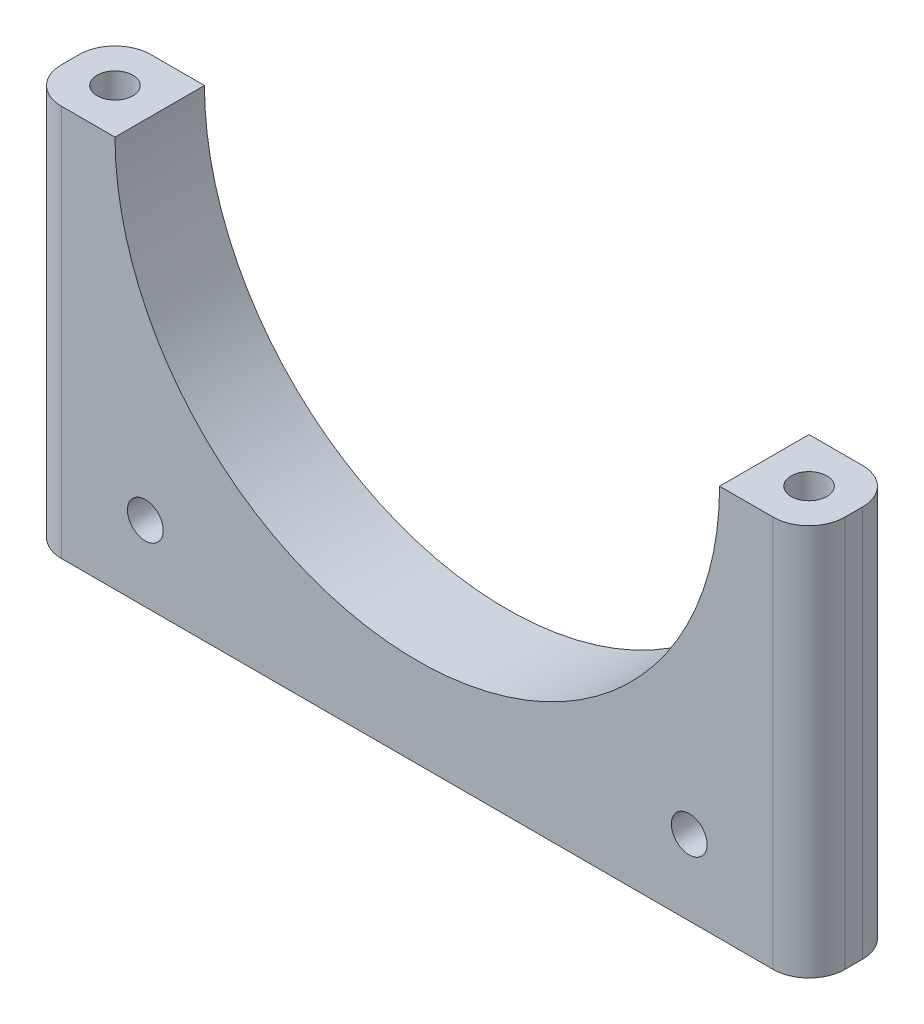
ISO-10303-21;
HEADER;
FILE_DESCRIPTION(('STEP AP214'),'2;1');
FILE_NAME('part.step','',(''),(''),'','','');
FILE_SCHEMA(('AUTOMOTIVE_DESIGN { 1 0 10303 214 1 1 1 1 }'));
ENDSEC;
DATA;
#1=APPLICATION_CONTEXT('core data for automotive mechanical design processes');
#2=APPLICATION_PROTOCOL_DEFINITION('international standard','automotive_design',2000,#1);
#3=PRODUCT_CONTEXT('',#1,'mechanical');
#4=PRODUCT('Part','Part','',(#3));
#5=PRODUCT_RELATED_PRODUCT_CATEGORY('part','',(#4));
#6=PRODUCT_DEFINITION_FORMATION('','',#4);
#7=PRODUCT_DEFINITION_CONTEXT('part definition',#1,'design');
#8=PRODUCT_DEFINITION('design','',#6,#7);
#9=PRODUCT_DEFINITION_SHAPE('','',#8);
#10=(LENGTH_UNIT() NAMED_UNIT(*) SI_UNIT(.MILLI.,.METRE.));
#11=(NAMED_UNIT(*) PLANE_ANGLE_UNIT() SI_UNIT($,.RADIAN.));
#12=(NAMED_UNIT(*) SI_UNIT($,.STERADIAN.) SOLID_ANGLE_UNIT());
#13=UNCERTAINTY_MEASURE_WITH_UNIT(LENGTH_MEASURE(1.E-05),#10,'distance_accuracy_value','');
#14=(GEOMETRIC_REPRESENTATION_CONTEXT(3) GLOBAL_UNCERTAINTY_ASSIGNED_CONTEXT((#13)) GLOBAL_UNIT_ASSIGNED_CONTEXT((#10,
#11,#12)) REPRESENTATION_CONTEXT('',''));
#15=CARTESIAN_POINT('',(0.,0.,0.));
#16=DIRECTION('',(0.,0.,1.));
#17=DIRECTION('',(1.,0.,0.));
#18=AXIS2_PLACEMENT_3D('',#15,#16,#17);
#19=CARTESIAN_POINT('',(0.,0.,25.));
#20=DIRECTION('',(0.,0.,1.));
#21=DIRECTION('',(1.,0.,0.));
#22=AXIS2_PLACEMENT_3D('',#19,#20,#21);
#23=PLANE('',#22);
#24=CARTESIAN_POINT('',(76.015,-3.99999999999999,25.));
#25=DIRECTION('',(0.,0.,1.));
#26=DIRECTION('',(1.,0.,0.));
#27=AXIS2_PLACEMENT_3D('',#24,#25,#26);
#28=CIRCLE('',#27,5.);
#29=CARTESIAN_POINT('',(81.015,-3.99999999999999,25.));
#30=VERTEX_POINT('',#29);
#31=EDGE_CURVE('E277',#30,#30,#28,.F.);
#32=ORIENTED_EDGE('',*,*,#31,.T.);
#33=EDGE_LOOP('',(#32));
#34=FACE_BOUND('',#33,.T.);
#35=DIRECTION('',(-1.,0.,0.));
#36=VECTOR('',#35,1.);
#37=CARTESIAN_POINT('',(0.,-25.,25.));
#38=LINE('',#37,#36);
#39=CARTESIAN_POINT('',(99.5,-25.,25.));
#40=VERTEX_POINT('',#39);
#41=CARTESIAN_POINT('',(-99.5,-25.,25.));
#42=VERTEX_POINT('',#41);
#43=EDGE_CURVE('E149',#40,#42,#38,.T.);
#44=ORIENTED_EDGE('',*,*,#43,.F.);
#45=DIRECTION('',(0.,-1.,0.));
#46=VECTOR('',#45,1.);
#47=CARTESIAN_POINT('',(99.5,0.,25.));
#48=LINE('',#47,#46);
#49=CARTESIAN_POINT('',(99.5,84.5,25.));
#50=VERTEX_POINT('',#49);
#51=EDGE_CURVE('E147',#40,#50,#48,.F.);
#52=ORIENTED_EDGE('',*,*,#51,.T.);
#53=DIRECTION('',(1.,0.,0.));
#54=VECTOR('',#53,1.);
#55=CARTESIAN_POINT('',(0.,84.5,25.));
#56=LINE('',#55,#54);
#57=CARTESIAN_POINT('',(84.5,84.5,25.));
#58=VERTEX_POINT('',#57);
#59=EDGE_CURVE('E128',#58,#50,#56,.T.);
#60=ORIENTED_EDGE('',*,*,#59,.F.);
#61=CARTESIAN_POINT('',(0.,84.5,25.));
#62=DIRECTION('',(0.,0.,1.));
#63=DIRECTION('',(1.,0.,0.));
#64=AXIS2_PLACEMENT_3D('',#61,#62,#63);
#65=CIRCLE('',#64,84.5);
#66=CARTESIAN_POINT('',(-84.5,84.5,25.));
#67=VERTEX_POINT('',#66);
#68=EDGE_CURVE('E145',#67,#58,#65,.T.);
#69=ORIENTED_EDGE('',*,*,#68,.F.);
#70=CARTESIAN_POINT('',(-99.5,84.5,25.));
#71=VERTEX_POINT('',#70);
#72=EDGE_CURVE('E151',#71,#67,#56,.T.);
#73=ORIENTED_EDGE('',*,*,#72,.F.);
#74=DIRECTION('',(0.,-1.,0.));
#75=VECTOR('',#74,1.);
#76=CARTESIAN_POINT('',(-99.5,-25.,25.));
#77=LINE('',#76,#75);
#78=EDGE_CURVE('E216',#71,#42,#77,.T.);
#79=ORIENTED_EDGE('',*,*,#78,.T.);
#80=EDGE_LOOP('',(#44,#52,#60,#69,#73,#79));
#81=FACE_BOUND('',#80,.T.);
#82=CARTESIAN_POINT('',(-76.015,-4.00000000000001,25.));
#83=DIRECTION('',(0.,0.,1.));
#84=DIRECTION('',(1.,0.,0.));
#85=AXIS2_PLACEMENT_3D('',#82,#83,#84);
#86=CIRCLE('',#85,4.99999999999999);
#87=CARTESIAN_POINT('',(-71.015,-4.00000000000001,25.));
#88=VERTEX_POINT('',#87);
#89=EDGE_CURVE('E193',#88,#88,#86,.T.);
#90=ORIENTED_EDGE('',*,*,#89,.F.);
#91=EDGE_LOOP('',(#90));
#92=FACE_BOUND('',#91,.T.);
#93=ADVANCED_FACE('F47',(#34,#81,#92),#23,.T.);
#94=CARTESIAN_POINT('',(0.,0.,0.));
#95=DIRECTION('',(0.,0.,1.));
#96=DIRECTION('',(1.,0.,0.));
#97=AXIS2_PLACEMENT_3D('',#94,#95,#96);
#98=PLANE('',#97);
#99=DIRECTION('',(1.,0.,0.));
#100=VECTOR('',#99,1.);
#101=CARTESIAN_POINT('',(0.,84.5,0.));
#102=LINE('',#101,#100);
#103=CARTESIAN_POINT('',(84.5,84.5,0.));
#104=VERTEX_POINT('',#103);
#105=CARTESIAN_POINT('',(99.5,84.5,0.));
#106=VERTEX_POINT('',#105);
#107=EDGE_CURVE('E131',#104,#106,#102,.T.);
#108=ORIENTED_EDGE('',*,*,#107,.T.);
#109=DIRECTION('',(0.,-1.,0.));
#110=VECTOR('',#109,1.);
#111=CARTESIAN_POINT('',(99.5,-25.,0.));
#112=LINE('',#111,#110);
#113=CARTESIAN_POINT('',(99.5,-25.,0.));
#114=VERTEX_POINT('',#113);
#115=EDGE_CURVE('E231',#106,#114,#112,.T.);
#116=ORIENTED_EDGE('',*,*,#115,.T.);
#117=DIRECTION('',(-1.,0.,0.));
#118=VECTOR('',#117,1.);
#119=CARTESIAN_POINT('',(0.,-25.,0.));
#120=LINE('',#119,#118);
#121=CARTESIAN_POINT('',(-99.5,-25.,0.));
#122=VERTEX_POINT('',#121);
#123=EDGE_CURVE('E161',#114,#122,#120,.T.);
#124=ORIENTED_EDGE('',*,*,#123,.T.);
#125=DIRECTION('',(0.,-1.,0.));
#126=VECTOR('',#125,1.);
#127=CARTESIAN_POINT('',(-99.5,0.,0.));
#128=LINE('',#127,#126);
#129=CARTESIAN_POINT('',(-99.5,84.5,0.));
#130=VERTEX_POINT('',#129);
#131=EDGE_CURVE('E228',#122,#130,#128,.F.);
#132=ORIENTED_EDGE('',*,*,#131,.T.);
#133=CARTESIAN_POINT('',(-84.5,84.5,0.));
#134=VERTEX_POINT('',#133);
#135=EDGE_CURVE('E169',#130,#134,#102,.T.);
#136=ORIENTED_EDGE('',*,*,#135,.T.);
#137=CARTESIAN_POINT('',(0.,84.5,0.));
#138=DIRECTION('',(0.,0.,1.));
#139=DIRECTION('',(1.,0.,0.));
#140=AXIS2_PLACEMENT_3D('',#137,#138,#139);
#141=CIRCLE('',#140,84.5);
#142=EDGE_CURVE('E168',#134,#104,#141,.T.);
#143=ORIENTED_EDGE('',*,*,#142,.T.);
#144=EDGE_LOOP('',(#108,#116,#124,#132,#136,#143));
#145=FACE_BOUND('',#144,.T.);
#146=CARTESIAN_POINT('',(76.015,-3.99999999999999,0.));
#147=DIRECTION('',(0.,0.,1.));
#148=DIRECTION('',(1.,0.,0.));
#149=AXIS2_PLACEMENT_3D('',#146,#147,#148);
#150=CIRCLE('',#149,5.);
#151=CARTESIAN_POINT('',(81.015,-3.99999999999999,0.));
#152=VERTEX_POINT('',#151);
#153=EDGE_CURVE('E188',#152,#152,#150,.F.);
#154=ORIENTED_EDGE('',*,*,#153,.F.);
#155=EDGE_LOOP('',(#154));
#156=FACE_BOUND('',#155,.T.);
#157=CARTESIAN_POINT('',(-76.015,-4.00000000000001,0.));
#158=DIRECTION('',(0.,0.,1.));
#159=DIRECTION('',(1.,0.,0.));
#160=AXIS2_PLACEMENT_3D('',#157,#158,#159);
#161=CIRCLE('',#160,4.99999999999999);
#162=CARTESIAN_POINT('',(-71.015,-4.00000000000001,0.));
#163=VERTEX_POINT('',#162);
#164=EDGE_CURVE('E192',#163,#163,#161,.T.);
#165=ORIENTED_EDGE('',*,*,#164,.T.);
#166=EDGE_LOOP('',(#165));
#167=FACE_BOUND('',#166,.T.);
#168=ADVANCED_FACE('F256',(#145,#156,#167),#98,.F.);
#169=CARTESIAN_POINT('',(0.,-25.,25.));
#170=DIRECTION('',(0.,-1.,0.));
#171=DIRECTION('',(0.,0.,-1.));
#172=AXIS2_PLACEMENT_3D('',#169,#170,#171);
#173=PLANE('',#172);
#174=CARTESIAN_POINT('',(97.,-25.0000000000004,12.5));
#175=DIRECTION('',(0.,-1.,0.));
#176=DIRECTION('',(0.,0.,-1.));
#177=AXIS2_PLACEMENT_3D('',#174,#175,#176);
#178=CIRCLE('',#177,5.);
#179=CARTESIAN_POINT('',(97.,-25.0000000000004,7.49999999999997));
#180=VERTEX_POINT('',#179);
#181=EDGE_CURVE('E165',#180,#180,#178,.F.);
#182=ORIENTED_EDGE('',*,*,#181,.T.);
#183=EDGE_LOOP('',(#182));
#184=FACE_BOUND('',#183,.T.);
#185=DIRECTION('',(0.,0.,-1.));
#186=VECTOR('',#185,1.);
#187=CARTESIAN_POINT('',(109.5,-25.,25.));
#188=LINE('',#187,#186);
#189=CARTESIAN_POINT('',(109.5,-25.,15.));
#190=VERTEX_POINT('',#189);
#191=CARTESIAN_POINT('',(109.5,-25.,10.));
#192=VERTEX_POINT('',#191);
#193=EDGE_CURVE('E183',#190,#192,#188,.T.);
#194=ORIENTED_EDGE('',*,*,#193,.F.);
#195=CARTESIAN_POINT('',(99.5,-25.,15.));
#196=DIRECTION('',(0.,-1.,0.));
#197=DIRECTION('',(0.,0.,-1.));
#198=AXIS2_PLACEMENT_3D('',#195,#196,#197);
#199=CIRCLE('',#198,10.);
#200=EDGE_CURVE('E213',#190,#40,#199,.T.);
#201=ORIENTED_EDGE('',*,*,#200,.T.);
#202=ORIENTED_EDGE('',*,*,#43,.T.);
#203=CARTESIAN_POINT('',(-99.5,-25.,15.));
#204=DIRECTION('',(0.,-1.,0.));
#205=DIRECTION('',(0.,0.,-1.));
#206=AXIS2_PLACEMENT_3D('',#203,#204,#205);
#207=CIRCLE('',#206,10.);
#208=CARTESIAN_POINT('',(-109.5,-25.,15.));
#209=VERTEX_POINT('',#208);
#210=EDGE_CURVE('E207',#42,#209,#207,.T.);
#211=ORIENTED_EDGE('',*,*,#210,.T.);
#212=DIRECTION('',(0.,0.,-1.));
#213=VECTOR('',#212,1.);
#214=CARTESIAN_POINT('',(-109.5,-25.,25.));
#215=LINE('',#214,#213);
#216=CARTESIAN_POINT('',(-109.5,-25.,10.));
#217=VERTEX_POINT('',#216);
#218=EDGE_CURVE('E158',#209,#217,#215,.T.);
#219=ORIENTED_EDGE('',*,*,#218,.T.);
#220=CARTESIAN_POINT('',(-99.5,-25.,10.));
#221=DIRECTION('',(0.,-1.,0.));
#222=DIRECTION('',(0.,0.,-1.));
#223=AXIS2_PLACEMENT_3D('',#220,#221,#222);
#224=CIRCLE('',#223,10.);
#225=EDGE_CURVE('E204',#217,#122,#224,.T.);
#226=ORIENTED_EDGE('',*,*,#225,.T.);
#227=ORIENTED_EDGE('',*,*,#123,.F.);
#228=CARTESIAN_POINT('',(99.5,-25.,10.));
#229=DIRECTION('',(0.,-1.,0.));
#230=DIRECTION('',(0.,0.,-1.));
#231=AXIS2_PLACEMENT_3D('',#228,#229,#230);
#232=CIRCLE('',#231,10.);
#233=EDGE_CURVE('E210',#114,#192,#232,.T.);
#234=ORIENTED_EDGE('',*,*,#233,.T.);
#235=EDGE_LOOP('',(#194,#201,#202,#211,#219,#226,#227,#234));
#236=FACE_BOUND('',#235,.T.);
#237=CARTESIAN_POINT('',(-97.,-25.0000000000004,12.5));
#238=DIRECTION('',(0.,-1.,0.));
#239=DIRECTION('',(0.,0.,-1.));
#240=AXIS2_PLACEMENT_3D('',#237,#238,#239);
#241=CIRCLE('',#240,5.);
#242=CARTESIAN_POINT('',(-97.,-25.0000000000004,7.5));
#243=VERTEX_POINT('',#242);
#244=EDGE_CURVE('E266',#243,#243,#241,.T.);
#245=ORIENTED_EDGE('',*,*,#244,.F.);
#246=EDGE_LOOP('',(#245));
#247=FACE_BOUND('',#246,.T.);
#248=ADVANCED_FACE('F246',(#184,#236,#247),#173,.T.);
#249=CARTESIAN_POINT('',(109.5,0.,25.));
#250=DIRECTION('',(1.,0.,0.));
#251=DIRECTION('',(0.,1.,0.));
#252=AXIS2_PLACEMENT_3D('',#249,#250,#251);
#253=PLANE('',#252);
#254=DIRECTION('',(0.,0.,-1.));
#255=VECTOR('',#254,1.);
#256=CARTESIAN_POINT('',(109.5,84.5,25.));
#257=LINE('',#256,#255);
#258=CARTESIAN_POINT('',(109.5,84.5,15.));
#259=VERTEX_POINT('',#258);
#260=CARTESIAN_POINT('',(109.5,84.5,10.));
#261=VERTEX_POINT('',#260);
#262=EDGE_CURVE('E137',#259,#261,#257,.T.);
#263=ORIENTED_EDGE('',*,*,#262,.F.);
#264=DIRECTION('',(0.,-1.,0.));
#265=VECTOR('',#264,1.);
#266=CARTESIAN_POINT('',(109.5,0.,15.));
#267=LINE('',#266,#265);
#268=EDGE_CURVE('E200',#259,#190,#267,.T.);
#269=ORIENTED_EDGE('',*,*,#268,.T.);
#270=ORIENTED_EDGE('',*,*,#193,.T.);
#271=DIRECTION('',(0.,-1.,0.));
#272=VECTOR('',#271,1.);
#273=CARTESIAN_POINT('',(109.5,84.5,10.));
#274=LINE('',#273,#272);
#275=EDGE_CURVE('E187',#192,#261,#274,.F.);
#276=ORIENTED_EDGE('',*,*,#275,.T.);
#277=EDGE_LOOP('',(#263,#269,#270,#276));
#278=FACE_BOUND('',#277,.T.);
#279=ADVANCED_FACE('F307',(#278),#253,.T.);
#280=CARTESIAN_POINT('',(0.,84.5,25.));
#281=DIRECTION('',(0.,1.,0.));
#282=DIRECTION('',(0.,0.,1.));
#283=AXIS2_PLACEMENT_3D('',#280,#281,#282);
#284=PLANE('',#283);
#285=CARTESIAN_POINT('',(97.,84.5,12.5));
#286=DIRECTION('',(0.,-1.,0.));
#287=DIRECTION('',(0.,0.,-1.));
#288=AXIS2_PLACEMENT_3D('',#285,#286,#287);
#289=CIRCLE('',#288,5.);
#290=CARTESIAN_POINT('',(97.,84.5,7.49999999999997));
#291=VERTEX_POINT('',#290);
#292=EDGE_CURVE('E197',#291,#291,#289,.T.);
#293=ORIENTED_EDGE('',*,*,#292,.T.);
#294=EDGE_LOOP('',(#293));
#295=FACE_BOUND('',#294,.T.);
#296=ORIENTED_EDGE('',*,*,#59,.T.);
#297=CARTESIAN_POINT('',(99.5,84.5,15.));
#298=DIRECTION('',(0.,1.,0.));
#299=DIRECTION('',(0.,0.,1.));
#300=AXIS2_PLACEMENT_3D('',#297,#298,#299);
#301=CIRCLE('',#300,10.);
#302=EDGE_CURVE('E225',#50,#259,#301,.T.);
#303=ORIENTED_EDGE('',*,*,#302,.T.);
#304=ORIENTED_EDGE('',*,*,#262,.T.);
#305=CARTESIAN_POINT('',(99.5,84.5,10.));
#306=DIRECTION('',(0.,1.,0.));
#307=DIRECTION('',(0.,0.,1.));
#308=AXIS2_PLACEMENT_3D('',#305,#306,#307);
#309=CIRCLE('',#308,10.);
#310=EDGE_CURVE('E222',#261,#106,#309,.T.);
#311=ORIENTED_EDGE('',*,*,#310,.T.);
#312=ORIENTED_EDGE('',*,*,#107,.F.);
#313=DIRECTION('',(0.,0.,-1.));
#314=VECTOR('',#313,1.);
#315=CARTESIAN_POINT('',(84.5,84.5,25.));
#316=LINE('',#315,#314);
#317=EDGE_CURVE('E125',#58,#104,#316,.T.);
#318=ORIENTED_EDGE('',*,*,#317,.F.);
#319=EDGE_LOOP('',(#296,#303,#304,#311,#312,#318));
#320=FACE_BOUND('',#319,.T.);
#321=ADVANCED_FACE('F127',(#295,#320),#284,.T.);
#322=CARTESIAN_POINT('',(0.,84.5,25.));
#323=DIRECTION('',(0.,0.,-1.));
#324=DIRECTION('',(-1.,0.,0.));
#325=AXIS2_PLACEMENT_3D('',#322,#323,#324);
#326=CYLINDRICAL_SURFACE('',#325,84.5);
#327=ORIENTED_EDGE('',*,*,#142,.F.);
#328=DIRECTION('',(0.,0.,-1.));
#329=VECTOR('',#328,1.);
#330=CARTESIAN_POINT('',(-84.5,84.5,25.));
#331=LINE('',#330,#329);
#332=EDGE_CURVE('E138',#67,#134,#331,.T.);
#333=ORIENTED_EDGE('',*,*,#332,.F.);
#334=ORIENTED_EDGE('',*,*,#68,.T.);
#335=ORIENTED_EDGE('',*,*,#317,.T.);
#336=EDGE_LOOP('',(#327,#333,#334,#335));
#337=FACE_BOUND('',#336,.T.);
#338=ADVANCED_FACE('F153',(#337),#326,.F.);
#339=CARTESIAN_POINT('',(-97.,84.5,12.5));
#340=DIRECTION('',(0.,1.,0.));
#341=DIRECTION('',(0.,0.,1.));
#342=AXIS2_PLACEMENT_3D('',#339,#340,#341);
#343=CIRCLE('',#342,5.);
#344=CARTESIAN_POINT('',(-97.,84.5,17.5));
#345=VERTEX_POINT('',#344);
#346=EDGE_CURVE('E270',#345,#345,#343,.T.);
#347=ORIENTED_EDGE('',*,*,#346,.F.);
#348=EDGE_LOOP('',(#347));
#349=FACE_BOUND('',#348,.T.);
#350=DIRECTION('',(0.,0.,-1.));
#351=VECTOR('',#350,1.);
#352=CARTESIAN_POINT('',(-109.5,84.5,25.));
#353=LINE('',#352,#351);
#354=CARTESIAN_POINT('',(-109.5,84.5,15.));
#355=VERTEX_POINT('',#354);
#356=CARTESIAN_POINT('',(-109.5,84.5,10.));
#357=VERTEX_POINT('',#356);
#358=EDGE_CURVE('E175',#355,#357,#353,.T.);
#359=ORIENTED_EDGE('',*,*,#358,.F.);
#360=CARTESIAN_POINT('',(-99.5,84.5,15.));
#361=DIRECTION('',(0.,1.,0.));
#362=DIRECTION('',(0.,0.,1.));
#363=AXIS2_PLACEMENT_3D('',#360,#361,#362);
#364=CIRCLE('',#363,10.);
#365=EDGE_CURVE('E11',#355,#71,#364,.T.);
#366=ORIENTED_EDGE('',*,*,#365,.T.);
#367=ORIENTED_EDGE('',*,*,#72,.T.);
#368=ORIENTED_EDGE('',*,*,#332,.T.);
#369=ORIENTED_EDGE('',*,*,#135,.F.);
#370=CARTESIAN_POINT('',(-99.5,84.5,10.));
#371=DIRECTION('',(0.,1.,0.));
#372=DIRECTION('',(0.,0.,1.));
#373=AXIS2_PLACEMENT_3D('',#370,#371,#372);
#374=CIRCLE('',#373,10.);
#375=EDGE_CURVE('E56',#130,#357,#374,.T.);
#376=ORIENTED_EDGE('',*,*,#375,.T.);
#377=EDGE_LOOP('',(#359,#366,#367,#368,#369,#376));
#378=FACE_BOUND('',#377,.T.);
#379=ADVANCED_FACE('F254',(#349,#378),#284,.T.);
#380=CARTESIAN_POINT('',(-109.5,0.,25.));
#381=DIRECTION('',(1.,0.,0.));
#382=DIRECTION('',(0.,1.,0.));
#383=AXIS2_PLACEMENT_3D('',#380,#381,#382);
#384=PLANE('',#383);
#385=ORIENTED_EDGE('',*,*,#218,.F.);
#386=DIRECTION('',(0.,-1.,0.));
#387=VECTOR('',#386,1.);
#388=CARTESIAN_POINT('',(-109.5,84.5,15.));
#389=LINE('',#388,#387);
#390=EDGE_CURVE('E69',#209,#355,#389,.F.);
#391=ORIENTED_EDGE('',*,*,#390,.T.);
#392=ORIENTED_EDGE('',*,*,#358,.T.);
#393=DIRECTION('',(0.,-1.,0.));
#394=VECTOR('',#393,1.);
#395=CARTESIAN_POINT('',(-109.5,0.,10.));
#396=LINE('',#395,#394);
#397=EDGE_CURVE('E235',#357,#217,#396,.T.);
#398=ORIENTED_EDGE('',*,*,#397,.T.);
#399=EDGE_LOOP('',(#385,#391,#392,#398));
#400=FACE_BOUND('',#399,.T.);
#401=ADVANCED_FACE('F242',(#400),#384,.F.);
#402=CARTESIAN_POINT('',(-97.,-4915.5,12.5));
#403=DIRECTION('',(0.,1.,0.));
#404=DIRECTION('',(0.,0.,1.));
#405=AXIS2_PLACEMENT_3D('',#402,#403,#404);
#406=CYLINDRICAL_SURFACE('',#405,5.);
#407=ORIENTED_EDGE('',*,*,#244,.T.);
#408=EDGE_LOOP('',(#407));
#409=FACE_BOUND('',#408,.T.);
#410=ORIENTED_EDGE('',*,*,#346,.T.);
#411=EDGE_LOOP('',(#410));
#412=FACE_BOUND('',#411,.T.);
#413=ADVANCED_FACE('F301',(#409,#412),#406,.F.);
#414=CARTESIAN_POINT('',(97.,-4915.5,12.5));
#415=DIRECTION('',(0.,1.,0.));
#416=DIRECTION('',(0.,0.,1.));
#417=AXIS2_PLACEMENT_3D('',#414,#415,#416);
#418=CYLINDRICAL_SURFACE('',#417,5.);
#419=ORIENTED_EDGE('',*,*,#181,.F.);
#420=EDGE_LOOP('',(#419));
#421=FACE_BOUND('',#420,.T.);
#422=ORIENTED_EDGE('',*,*,#292,.F.);
#423=EDGE_LOOP('',(#422));
#424=FACE_BOUND('',#423,.T.);
#425=ADVANCED_FACE('F296',(#421,#424),#418,.F.);
#426=CARTESIAN_POINT('',(76.015,-3.99999999999999,-4975.));
#427=DIRECTION('',(0.,0.,1.));
#428=DIRECTION('',(1.,0.,0.));
#429=AXIS2_PLACEMENT_3D('',#426,#427,#428);
#430=CYLINDRICAL_SURFACE('',#429,5.);
#431=ORIENTED_EDGE('',*,*,#31,.F.);
#432=EDGE_LOOP('',(#431));
#433=FACE_BOUND('',#432,.T.);
#434=ORIENTED_EDGE('',*,*,#153,.T.);
#435=EDGE_LOOP('',(#434));
#436=FACE_BOUND('',#435,.T.);
#437=ADVANCED_FACE('F352',(#433,#436),#430,.F.);
#438=CARTESIAN_POINT('',(-76.015,-4.00000000000001,-4975.));
#439=DIRECTION('',(0.,0.,1.));
#440=DIRECTION('',(1.,0.,0.));
#441=AXIS2_PLACEMENT_3D('',#438,#439,#440);
#442=CYLINDRICAL_SURFACE('',#441,4.99999999999999);
#443=ORIENTED_EDGE('',*,*,#89,.T.);
#444=EDGE_LOOP('',(#443));
#445=FACE_BOUND('',#444,.T.);
#446=ORIENTED_EDGE('',*,*,#164,.F.);
#447=EDGE_LOOP('',(#446));
#448=FACE_BOUND('',#447,.T.);
#449=ADVANCED_FACE('F285',(#445,#448),#442,.F.);
#450=CARTESIAN_POINT('',(99.5,0.,15.));
#451=DIRECTION('',(0.,-1.,0.));
#452=DIRECTION('',(1.,0.,0.));
#453=AXIS2_PLACEMENT_3D('',#450,#451,#452);
#454=CYLINDRICAL_SURFACE('',#453,10.);
#455=ORIENTED_EDGE('',*,*,#302,.F.);
#456=ORIENTED_EDGE('',*,*,#51,.F.);
#457=ORIENTED_EDGE('',*,*,#200,.F.);
#458=ORIENTED_EDGE('',*,*,#268,.F.);
#459=EDGE_LOOP('',(#455,#456,#457,#458));
#460=FACE_BOUND('',#459,.T.);
#461=ADVANCED_FACE('F314',(#460),#454,.T.);
#462=CARTESIAN_POINT('',(99.5,0.,10.));
#463=DIRECTION('',(0.,1.,0.));
#464=DIRECTION('',(-1.,0.,0.));
#465=AXIS2_PLACEMENT_3D('',#462,#463,#464);
#466=CYLINDRICAL_SURFACE('',#465,10.);
#467=ORIENTED_EDGE('',*,*,#310,.F.);
#468=ORIENTED_EDGE('',*,*,#275,.F.);
#469=ORIENTED_EDGE('',*,*,#233,.F.);
#470=ORIENTED_EDGE('',*,*,#115,.F.);
#471=EDGE_LOOP('',(#467,#468,#469,#470));
#472=FACE_BOUND('',#471,.T.);
#473=ADVANCED_FACE('F317',(#472),#466,.T.);
#474=CARTESIAN_POINT('',(-99.5,0.,15.));
#475=DIRECTION('',(0.,1.,0.));
#476=DIRECTION('',(-1.,0.,0.));
#477=AXIS2_PLACEMENT_3D('',#474,#475,#476);
#478=CYLINDRICAL_SURFACE('',#477,10.);
#479=ORIENTED_EDGE('',*,*,#365,.F.);
#480=ORIENTED_EDGE('',*,*,#390,.F.);
#481=ORIENTED_EDGE('',*,*,#210,.F.);
#482=ORIENTED_EDGE('',*,*,#78,.F.);
#483=EDGE_LOOP('',(#479,#480,#481,#482));
#484=FACE_BOUND('',#483,.T.);
#485=ADVANCED_FACE('F253',(#484),#478,.T.);
#486=CARTESIAN_POINT('',(-99.5,0.,10.));
#487=DIRECTION('',(0.,-1.,0.));
#488=DIRECTION('',(1.,0.,0.));
#489=AXIS2_PLACEMENT_3D('',#486,#487,#488);
#490=CYLINDRICAL_SURFACE('',#489,10.);
#491=ORIENTED_EDGE('',*,*,#375,.F.);
#492=ORIENTED_EDGE('',*,*,#131,.F.);
#493=ORIENTED_EDGE('',*,*,#225,.F.);
#494=ORIENTED_EDGE('',*,*,#397,.F.);
#495=EDGE_LOOP('',(#491,#492,#493,#494));
#496=FACE_BOUND('',#495,.T.);
#497=ADVANCED_FACE('F49',(#496),#490,.T.);
#498=CLOSED_SHELL('',(#93,#168,#248,#279,#321,#338,#379,#401,#413,#425,#437,#449,#461,#473,#485,#497));
#499=MANIFOLD_SOLID_BREP('B2',#498);
#500=ADVANCED_BREP_SHAPE_REPRESENTATION('',(#18,#499),#14);
#501=SHAPE_DEFINITION_REPRESENTATION(#9,#500);
ENDSEC;
END-ISO-10303-21;
